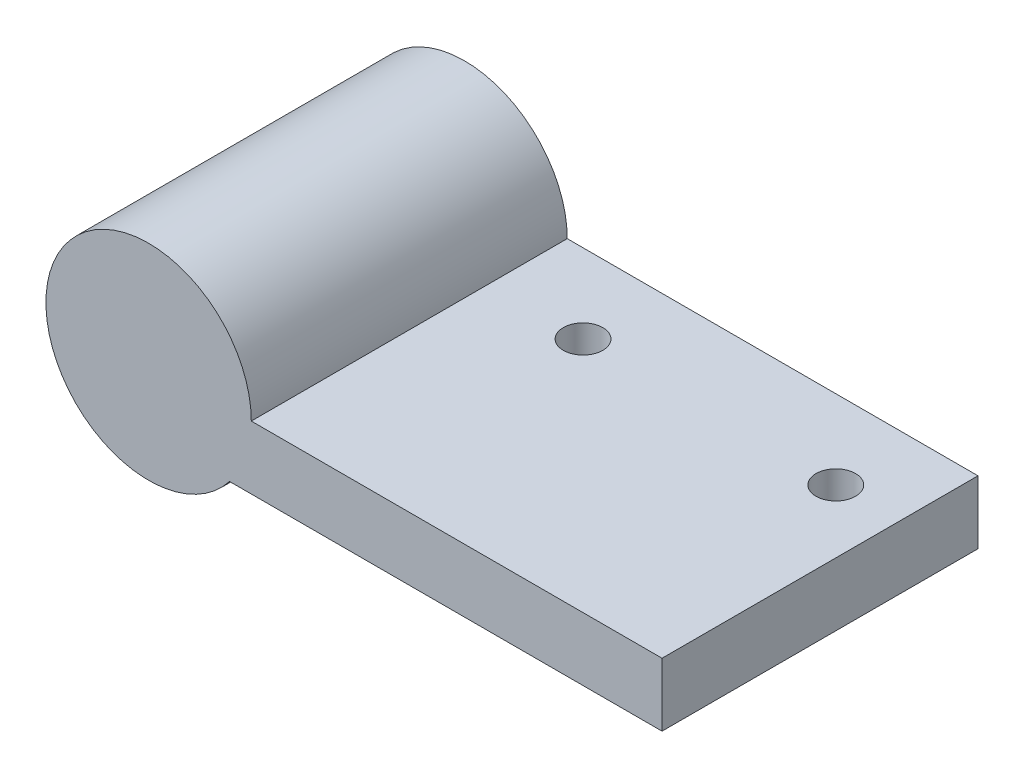
ISO-10303-21;
HEADER;
FILE_DESCRIPTION(('STEP AP214'),'2;1');
FILE_NAME('part.step','',(''),(''),'','','');
FILE_SCHEMA(('AUTOMOTIVE_DESIGN { 1 0 10303 214 1 1 1 1 }'));
ENDSEC;
DATA;
#1=APPLICATION_CONTEXT('core data for automotive mechanical design processes');
#2=APPLICATION_PROTOCOL_DEFINITION('international standard','automotive_design',2000,#1);
#3=PRODUCT_CONTEXT('',#1,'mechanical');
#4=PRODUCT('Part','Part','',(#3));
#5=PRODUCT_RELATED_PRODUCT_CATEGORY('part','',(#4));
#6=PRODUCT_DEFINITION_FORMATION('','',#4);
#7=PRODUCT_DEFINITION_CONTEXT('part definition',#1,'design');
#8=PRODUCT_DEFINITION('design','',#6,#7);
#9=PRODUCT_DEFINITION_SHAPE('','',#8);
#10=(LENGTH_UNIT() NAMED_UNIT(*) SI_UNIT(.MILLI.,.METRE.));
#11=(NAMED_UNIT(*) PLANE_ANGLE_UNIT() SI_UNIT($,.RADIAN.));
#12=(NAMED_UNIT(*) SI_UNIT($,.STERADIAN.) SOLID_ANGLE_UNIT());
#13=UNCERTAINTY_MEASURE_WITH_UNIT(LENGTH_MEASURE(1.E-05),#10,'distance_accuracy_value','');
#14=(GEOMETRIC_REPRESENTATION_CONTEXT(3) GLOBAL_UNCERTAINTY_ASSIGNED_CONTEXT((#13)) GLOBAL_UNIT_ASSIGNED_CONTEXT((#10,
#11,#12)) REPRESENTATION_CONTEXT('',''));
#15=CARTESIAN_POINT('',(0.,0.,0.));
#16=DIRECTION('',(0.,0.,1.));
#17=DIRECTION('',(1.,0.,0.));
#18=AXIS2_PLACEMENT_3D('',#15,#16,#17);
#19=CARTESIAN_POINT('',(0.,0.,20.));
#20=DIRECTION('',(0.,0.,-1.));
#21=DIRECTION('',(-1.,0.,0.));
#22=AXIS2_PLACEMENT_3D('',#19,#20,#21);
#23=CYLINDRICAL_SURFACE('',#22,4.15);
#24=CARTESIAN_POINT('',(0.,0.,0.));
#25=DIRECTION('',(0.,0.,1.));
#26=DIRECTION('',(1.,0.,0.));
#27=AXIS2_PLACEMENT_3D('',#24,#25,#26);
#28=CIRCLE('',#27,4.15);
#29=CARTESIAN_POINT('',(4.15,0.,0.));
#30=VERTEX_POINT('',#29);
#31=EDGE_CURVE('E122',#30,#30,#28,.T.);
#32=ORIENTED_EDGE('',*,*,#31,.F.);
#33=EDGE_LOOP('',(#32));
#34=FACE_BOUND('',#33,.T.);
#35=CARTESIAN_POINT('',(0.,0.,17.));
#36=DIRECTION('',(0.,0.,1.));
#37=DIRECTION('',(1.,0.,0.));
#38=AXIS2_PLACEMENT_3D('',#35,#36,#37);
#39=CIRCLE('',#38,4.15);
#40=CARTESIAN_POINT('',(4.15,0.,17.));
#41=VERTEX_POINT('',#40);
#42=EDGE_CURVE('E51',#41,#41,#39,.T.);
#43=ORIENTED_EDGE('',*,*,#42,.T.);
#44=EDGE_LOOP('',(#43));
#45=FACE_BOUND('',#44,.T.);
#46=ADVANCED_FACE('F47',(#34,#45),#23,.F.);
#47=CARTESIAN_POINT('',(0.,0.,20.));
#48=DIRECTION('',(0.,0.,1.));
#49=DIRECTION('',(1.,0.,0.));
#50=AXIS2_PLACEMENT_3D('',#47,#48,#49);
#51=PLANE('',#50);
#52=CARTESIAN_POINT('',(0.,0.,20.));
#53=DIRECTION('',(0.,0.,1.));
#54=DIRECTION('',(1.,0.,0.));
#55=AXIS2_PLACEMENT_3D('',#52,#53,#54);
#56=CIRCLE('',#55,6.5);
#57=CARTESIAN_POINT('',(6.5,0.,20.));
#58=VERTEX_POINT('',#57);
#59=CARTESIAN_POINT('',(5.1234753829798,-4.,20.));
#60=VERTEX_POINT('',#59);
#61=EDGE_CURVE('E101',#58,#60,#56,.T.);
#62=ORIENTED_EDGE('',*,*,#61,.T.);
#63=DIRECTION('',(1.,0.,0.));
#64=VECTOR('',#63,1.);
#65=CARTESIAN_POINT('',(5.1234753829798,-4.,20.));
#66=LINE('',#65,#64);
#67=CARTESIAN_POINT('',(32.5,-4.,20.));
#68=VERTEX_POINT('',#67);
#69=EDGE_CURVE('E96',#60,#68,#66,.T.);
#70=ORIENTED_EDGE('',*,*,#69,.T.);
#71=DIRECTION('',(0.,1.,0.));
#72=VECTOR('',#71,1.);
#73=CARTESIAN_POINT('',(32.5,-4.,20.));
#74=LINE('',#73,#72);
#75=CARTESIAN_POINT('',(32.5,0.,20.));
#76=VERTEX_POINT('',#75);
#77=EDGE_CURVE('E99',#68,#76,#74,.T.);
#78=ORIENTED_EDGE('',*,*,#77,.T.);
#79=DIRECTION('',(-1.,0.,0.));
#80=VECTOR('',#79,1.);
#81=CARTESIAN_POINT('',(32.5,0.,20.));
#82=LINE('',#81,#80);
#83=EDGE_CURVE('E66',#76,#58,#82,.T.);
#84=ORIENTED_EDGE('',*,*,#83,.T.);
#85=EDGE_LOOP('',(#62,#70,#78,#84));
#86=FACE_BOUND('',#85,.T.);
#87=ADVANCED_FACE('F97',(#86),#51,.T.);
#88=CARTESIAN_POINT('',(0.,0.,0.));
#89=DIRECTION('',(0.,0.,1.));
#90=DIRECTION('',(1.,0.,0.));
#91=AXIS2_PLACEMENT_3D('',#88,#89,#90);
#92=PLANE('',#91);
#93=CARTESIAN_POINT('',(0.,0.,0.));
#94=DIRECTION('',(0.,0.,1.));
#95=DIRECTION('',(1.,0.,0.));
#96=AXIS2_PLACEMENT_3D('',#93,#94,#95);
#97=CIRCLE('',#96,6.5);
#98=CARTESIAN_POINT('',(6.5,0.,0.));
#99=VERTEX_POINT('',#98);
#100=CARTESIAN_POINT('',(5.1234753829798,-4.,0.));
#101=VERTEX_POINT('',#100);
#102=EDGE_CURVE('E118',#99,#101,#97,.T.);
#103=ORIENTED_EDGE('',*,*,#102,.F.);
#104=DIRECTION('',(-1.,0.,0.));
#105=VECTOR('',#104,1.);
#106=CARTESIAN_POINT('',(32.5,0.,0.));
#107=LINE('',#106,#105);
#108=CARTESIAN_POINT('',(32.5,0.,0.));
#109=VERTEX_POINT('',#108);
#110=EDGE_CURVE('E89',#109,#99,#107,.T.);
#111=ORIENTED_EDGE('',*,*,#110,.F.);
#112=DIRECTION('',(0.,1.,0.));
#113=VECTOR('',#112,1.);
#114=CARTESIAN_POINT('',(32.5,-4.,0.));
#115=LINE('',#114,#113);
#116=CARTESIAN_POINT('',(32.5,-4.,0.));
#117=VERTEX_POINT('',#116);
#118=EDGE_CURVE('E83',#117,#109,#115,.T.);
#119=ORIENTED_EDGE('',*,*,#118,.F.);
#120=DIRECTION('',(1.,0.,0.));
#121=VECTOR('',#120,1.);
#122=CARTESIAN_POINT('',(5.1234753829798,-4.,0.));
#123=LINE('',#122,#121);
#124=EDGE_CURVE('E106',#101,#117,#123,.T.);
#125=ORIENTED_EDGE('',*,*,#124,.F.);
#126=EDGE_LOOP('',(#103,#111,#119,#125));
#127=FACE_BOUND('',#126,.T.);
#128=ORIENTED_EDGE('',*,*,#31,.T.);
#129=EDGE_LOOP('',(#128));
#130=FACE_BOUND('',#129,.T.);
#131=ADVANCED_FACE('F135',(#127,#130),#92,.F.);
#132=CARTESIAN_POINT('',(0.,0.,20.));
#133=DIRECTION('',(0.,0.,-1.));
#134=DIRECTION('',(-1.,0.,0.));
#135=AXIS2_PLACEMENT_3D('',#132,#133,#134);
#136=CYLINDRICAL_SURFACE('',#135,6.5);
#137=ORIENTED_EDGE('',*,*,#102,.T.);
#138=DIRECTION('',(0.,0.,-1.));
#139=VECTOR('',#138,1.);
#140=CARTESIAN_POINT('',(5.1234753829798,-4.,20.));
#141=LINE('',#140,#139);
#142=EDGE_CURVE('E11',#60,#101,#141,.T.);
#143=ORIENTED_EDGE('',*,*,#142,.F.);
#144=ORIENTED_EDGE('',*,*,#61,.F.);
#145=DIRECTION('',(0.,0.,-1.));
#146=VECTOR('',#145,1.);
#147=CARTESIAN_POINT('',(6.5,0.,20.));
#148=LINE('',#147,#146);
#149=EDGE_CURVE('E114',#58,#99,#148,.T.);
#150=ORIENTED_EDGE('',*,*,#149,.T.);
#151=EDGE_LOOP('',(#137,#143,#144,#150));
#152=FACE_BOUND('',#151,.T.);
#153=ADVANCED_FACE('F49',(#152),#136,.T.);
#154=CARTESIAN_POINT('',(5.1234753829798,-4.,20.));
#155=DIRECTION('',(0.,1.,0.));
#156=DIRECTION('',(0.,0.,1.));
#157=AXIS2_PLACEMENT_3D('',#154,#155,#156);
#158=PLANE('',#157);
#159=CARTESIAN_POINT('',(12.5,-4.,5.));
#160=DIRECTION('',(0.,1.,0.));
#161=DIRECTION('',(0.,0.,1.));
#162=AXIS2_PLACEMENT_3D('',#159,#160,#161);
#163=CIRCLE('',#162,1.25);
#164=CARTESIAN_POINT('',(12.5,-4.,6.25));
#165=VERTEX_POINT('',#164);
#166=EDGE_CURVE('E143',#165,#165,#163,.T.);
#167=ORIENTED_EDGE('',*,*,#166,.T.);
#168=EDGE_LOOP('',(#167));
#169=FACE_BOUND('',#168,.T.);
#170=CARTESIAN_POINT('',(28.5,-4.,5.));
#171=DIRECTION('',(0.,1.,0.));
#172=DIRECTION('',(0.,0.,1.));
#173=AXIS2_PLACEMENT_3D('',#170,#171,#172);
#174=CIRCLE('',#173,1.25);
#175=CARTESIAN_POINT('',(28.5,-4.,6.25));
#176=VERTEX_POINT('',#175);
#177=EDGE_CURVE('E147',#176,#176,#174,.T.);
#178=ORIENTED_EDGE('',*,*,#177,.T.);
#179=EDGE_LOOP('',(#178));
#180=FACE_BOUND('',#179,.T.);
#181=ORIENTED_EDGE('',*,*,#124,.T.);
#182=DIRECTION('',(0.,0.,-1.));
#183=VECTOR('',#182,1.);
#184=CARTESIAN_POINT('',(32.5,-4.,20.));
#185=LINE('',#184,#183);
#186=EDGE_CURVE('E58',#68,#117,#185,.T.);
#187=ORIENTED_EDGE('',*,*,#186,.F.);
#188=ORIENTED_EDGE('',*,*,#69,.F.);
#189=ORIENTED_EDGE('',*,*,#142,.T.);
#190=EDGE_LOOP('',(#181,#187,#188,#189));
#191=FACE_BOUND('',#190,.T.);
#192=ADVANCED_FACE('F105',(#169,#180,#191),#158,.F.);
#193=CARTESIAN_POINT('',(32.5,-4.,20.));
#194=DIRECTION('',(-1.,0.,0.));
#195=DIRECTION('',(0.,0.,1.));
#196=AXIS2_PLACEMENT_3D('',#193,#194,#195);
#197=PLANE('',#196);
#198=ORIENTED_EDGE('',*,*,#118,.T.);
#199=DIRECTION('',(0.,0.,-1.));
#200=VECTOR('',#199,1.);
#201=CARTESIAN_POINT('',(32.5,0.,20.));
#202=LINE('',#201,#200);
#203=EDGE_CURVE('E108',#76,#109,#202,.T.);
#204=ORIENTED_EDGE('',*,*,#203,.F.);
#205=ORIENTED_EDGE('',*,*,#77,.F.);
#206=ORIENTED_EDGE('',*,*,#186,.T.);
#207=EDGE_LOOP('',(#198,#204,#205,#206));
#208=FACE_BOUND('',#207,.T.);
#209=ADVANCED_FACE('F110',(#208),#197,.F.);
#210=CARTESIAN_POINT('',(32.5,0.,20.));
#211=DIRECTION('',(0.,-1.,0.));
#212=DIRECTION('',(1.,0.,0.));
#213=AXIS2_PLACEMENT_3D('',#210,#211,#212);
#214=PLANE('',#213);
#215=CARTESIAN_POINT('',(12.5,0.,5.));
#216=DIRECTION('',(0.,1.,0.));
#217=DIRECTION('',(-1.,0.,0.));
#218=AXIS2_PLACEMENT_3D('',#215,#216,#217);
#219=CIRCLE('',#218,1.25);
#220=CARTESIAN_POINT('',(11.25,0.,5.));
#221=VERTEX_POINT('',#220);
#222=EDGE_CURVE('E151',#221,#221,#219,.T.);
#223=ORIENTED_EDGE('',*,*,#222,.F.);
#224=EDGE_LOOP('',(#223));
#225=FACE_BOUND('',#224,.T.);
#226=CARTESIAN_POINT('',(28.5,0.,5.));
#227=DIRECTION('',(0.,1.,0.));
#228=DIRECTION('',(-1.,0.,0.));
#229=AXIS2_PLACEMENT_3D('',#226,#227,#228);
#230=CIRCLE('',#229,1.25);
#231=CARTESIAN_POINT('',(27.25,0.,5.));
#232=VERTEX_POINT('',#231);
#233=EDGE_CURVE('E152',#232,#232,#230,.T.);
#234=ORIENTED_EDGE('',*,*,#233,.F.);
#235=EDGE_LOOP('',(#234));
#236=FACE_BOUND('',#235,.T.);
#237=ORIENTED_EDGE('',*,*,#110,.T.);
#238=ORIENTED_EDGE('',*,*,#149,.F.);
#239=ORIENTED_EDGE('',*,*,#83,.F.);
#240=ORIENTED_EDGE('',*,*,#203,.T.);
#241=EDGE_LOOP('',(#237,#238,#239,#240));
#242=FACE_BOUND('',#241,.T.);
#243=ADVANCED_FACE('F132',(#225,#236,#242),#214,.F.);
#244=CARTESIAN_POINT('',(0.,0.,17.));
#245=DIRECTION('',(0.,0.,1.));
#246=DIRECTION('',(1.,0.,0.));
#247=AXIS2_PLACEMENT_3D('',#244,#245,#246);
#248=PLANE('',#247);
#249=ORIENTED_EDGE('',*,*,#42,.F.);
#250=EDGE_LOOP('',(#249));
#251=FACE_BOUND('',#250,.T.);
#252=ADVANCED_FACE('F165',(#251),#248,.F.);
#253=CARTESIAN_POINT('',(28.5,-13.,5.));
#254=DIRECTION('',(0.,1.,0.));
#255=DIRECTION('',(-1.,0.,0.));
#256=AXIS2_PLACEMENT_3D('',#253,#254,#255);
#257=CYLINDRICAL_SURFACE('',#256,1.25);
#258=ORIENTED_EDGE('',*,*,#233,.T.);
#259=EDGE_LOOP('',(#258));
#260=FACE_BOUND('',#259,.T.);
#261=ORIENTED_EDGE('',*,*,#177,.F.);
#262=EDGE_LOOP('',(#261));
#263=FACE_BOUND('',#262,.T.);
#264=ADVANCED_FACE('F169',(#260,#263),#257,.F.);
#265=CARTESIAN_POINT('',(12.5,-13.,5.));
#266=DIRECTION('',(0.,1.,0.));
#267=DIRECTION('',(-1.,0.,0.));
#268=AXIS2_PLACEMENT_3D('',#265,#266,#267);
#269=CYLINDRICAL_SURFACE('',#268,1.25);
#270=ORIENTED_EDGE('',*,*,#222,.T.);
#271=EDGE_LOOP('',(#270));
#272=FACE_BOUND('',#271,.T.);
#273=ORIENTED_EDGE('',*,*,#166,.F.);
#274=EDGE_LOOP('',(#273));
#275=FACE_BOUND('',#274,.T.);
#276=ADVANCED_FACE('F160',(#272,#275),#269,.F.);
#277=CLOSED_SHELL('',(#46,#87,#131,#153,#192,#209,#243,#252,#264,#276));
#278=MANIFOLD_SOLID_BREP('B2',#277);
#279=ADVANCED_BREP_SHAPE_REPRESENTATION('',(#18,#278),#14);
#280=SHAPE_DEFINITION_REPRESENTATION(#9,#279);
ENDSEC;
END-ISO-10303-21;
